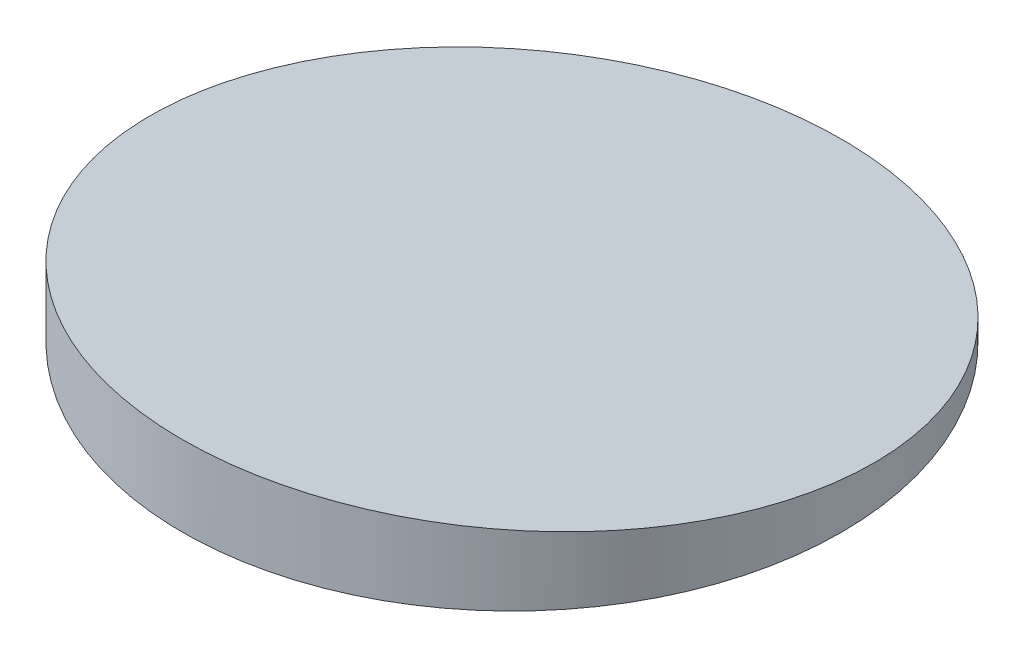
ISO-10303-21;
HEADER;
FILE_DESCRIPTION(('STEP AP214'),'2;1');
FILE_NAME('part.step','',(''),(''),'','','');
FILE_SCHEMA(('AUTOMOTIVE_DESIGN { 1 0 10303 214 1 1 1 1 }'));
ENDSEC;
DATA;
#1=APPLICATION_CONTEXT('core data for automotive mechanical design processes');
#2=APPLICATION_PROTOCOL_DEFINITION('international standard','automotive_design',2000,#1);
#3=PRODUCT_CONTEXT('',#1,'mechanical');
#4=PRODUCT('Part','Part','',(#3));
#5=PRODUCT_RELATED_PRODUCT_CATEGORY('part','',(#4));
#6=PRODUCT_DEFINITION_FORMATION('','',#4);
#7=PRODUCT_DEFINITION_CONTEXT('part definition',#1,'design');
#8=PRODUCT_DEFINITION('design','',#6,#7);
#9=PRODUCT_DEFINITION_SHAPE('','',#8);
#10=(LENGTH_UNIT() NAMED_UNIT(*) SI_UNIT(.MILLI.,.METRE.));
#11=(NAMED_UNIT(*) PLANE_ANGLE_UNIT() SI_UNIT($,.RADIAN.));
#12=(NAMED_UNIT(*) SI_UNIT($,.STERADIAN.) SOLID_ANGLE_UNIT());
#13=UNCERTAINTY_MEASURE_WITH_UNIT(LENGTH_MEASURE(1.E-05),#10,'distance_accuracy_value','');
#14=(GEOMETRIC_REPRESENTATION_CONTEXT(3) GLOBAL_UNCERTAINTY_ASSIGNED_CONTEXT((#13)) GLOBAL_UNIT_ASSIGNED_CONTEXT((#10,
#11,#12)) REPRESENTATION_CONTEXT('',''));
#15=CARTESIAN_POINT('',(0.,0.,0.));
#16=DIRECTION('',(0.,0.,1.));
#17=DIRECTION('',(1.,0.,0.));
#18=AXIS2_PLACEMENT_3D('',#15,#16,#17);
#19=CARTESIAN_POINT('',(-132.804,5407.85755819517,-698.319253830587));
#20=DIRECTION('',(0.,0.994521895368274,-0.104528463267651));
#21=DIRECTION('',(0.,0.104528463267651,0.994521895368274));
#22=AXIS2_PLACEMENT_3D('',#19,#20,#21);
#23=PLANE('',#22);
#24=CARTESIAN_POINT('',(7.69791068495818E-13,5407.85755819517,-698.319253830586));
#25=DIRECTION('',(0.,0.994521895368274,-0.104528463267651));
#26=DIRECTION('',(8.03360702983092E-13,0.104528463267651,0.994521895368274));
#27=AXIS2_PLACEMENT_3D('',#24,#25,#26);
#28=ELLIPSE('',#27,65.3580381716289,65.);
#29=CARTESIAN_POINT('',(5.32758705596514E-11,5414.68933348744,-633.319253830586));
#30=VERTEX_POINT('',#29);
#31=EDGE_CURVE('E19',#30,#30,#28,.F.);
#32=ORIENTED_EDGE('',*,*,#31,.F.);
#33=EDGE_LOOP('',(#32));
#34=FACE_BOUND('',#33,.T.);
#35=ADVANCED_FACE('F15',(#34),#23,.T.);
#36=CARTESIAN_POINT('',(0.,5398.85755819517,-698.319253830587));
#37=DIRECTION('',(0.,1.,0.));
#38=DIRECTION('',(-1.,0.,0.));
#39=AXIS2_PLACEMENT_3D('',#36,#37,#38);
#40=CYLINDRICAL_SURFACE('',#39,65.);
#41=ORIENTED_EDGE('',*,*,#31,.T.);
#42=EDGE_LOOP('',(#41));
#43=FACE_BOUND('',#42,.T.);
#44=CARTESIAN_POINT('',(-3.62376795237969E-13,5398.85755819517,-698.319253830587));
#45=DIRECTION('',(0.,1.,0.));
#46=DIRECTION('',(-1.,0.,0.));
#47=AXIS2_PLACEMENT_3D('',#44,#45,#46);
#48=CIRCLE('',#47,65.);
#49=CARTESIAN_POINT('',(-65.0000000000004,5398.85755819517,-698.319253830587));
#50=VERTEX_POINT('',#49);
#51=EDGE_CURVE('E10',#50,#50,#48,.F.);
#52=ORIENTED_EDGE('',*,*,#51,.F.);
#53=EDGE_LOOP('',(#52));
#54=FACE_BOUND('',#53,.T.);
#55=ADVANCED_FACE('F28',(#43,#54),#40,.T.);
#56=CARTESIAN_POINT('',(0.,5398.85755819517,-565.515253830587));
#57=DIRECTION('',(0.,-1.,0.));
#58=DIRECTION('',(0.,0.,-1.));
#59=AXIS2_PLACEMENT_3D('',#56,#57,#58);
#60=PLANE('',#59);
#61=ORIENTED_EDGE('',*,*,#51,.T.);
#62=EDGE_LOOP('',(#61));
#63=FACE_BOUND('',#62,.T.);
#64=ADVANCED_FACE('F17',(#63),#60,.T.);
#65=CLOSED_SHELL('',(#35,#55,#64));
#66=MANIFOLD_SOLID_BREP('B1',#65);
#67=ADVANCED_BREP_SHAPE_REPRESENTATION('',(#18,#66),#14);
#68=SHAPE_DEFINITION_REPRESENTATION(#9,#67);
ENDSEC;
END-ISO-10303-21;
